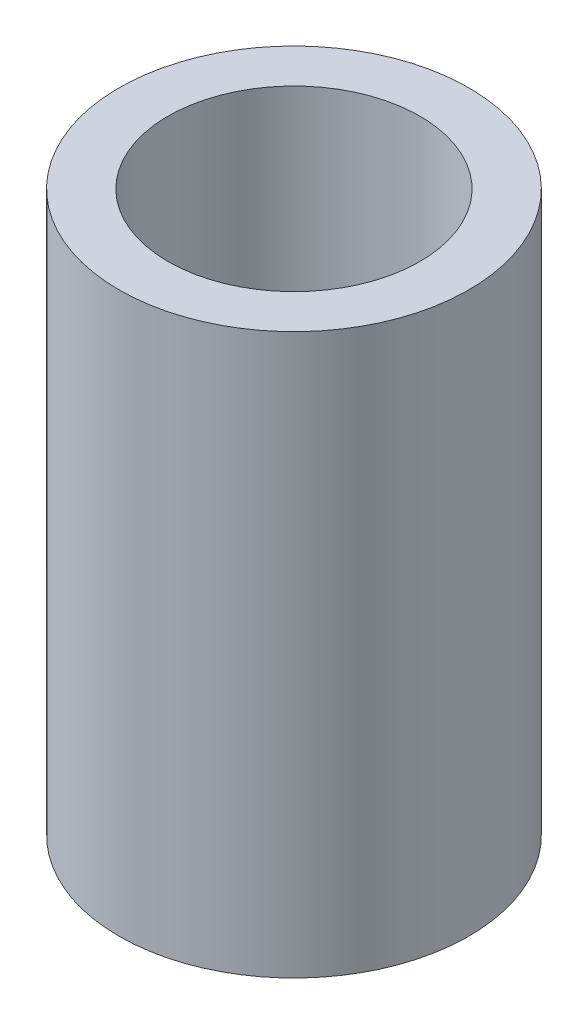
ISO-10303-21;
HEADER;
FILE_DESCRIPTION(('STEP AP214'),'2;1');
FILE_NAME('part.step','',(''),(''),'','','');
FILE_SCHEMA(('AUTOMOTIVE_DESIGN { 1 0 10303 214 1 1 1 1 }'));
ENDSEC;
DATA;
#1=APPLICATION_CONTEXT('core data for automotive mechanical design processes');
#2=APPLICATION_PROTOCOL_DEFINITION('international standard','automotive_design',2000,#1);
#3=PRODUCT_CONTEXT('',#1,'mechanical');
#4=PRODUCT('Part','Part','',(#3));
#5=PRODUCT_RELATED_PRODUCT_CATEGORY('part','',(#4));
#6=PRODUCT_DEFINITION_FORMATION('','',#4);
#7=PRODUCT_DEFINITION_CONTEXT('part definition',#1,'design');
#8=PRODUCT_DEFINITION('design','',#6,#7);
#9=PRODUCT_DEFINITION_SHAPE('','',#8);
#10=(LENGTH_UNIT() NAMED_UNIT(*) SI_UNIT(.MILLI.,.METRE.));
#11=(NAMED_UNIT(*) PLANE_ANGLE_UNIT() SI_UNIT($,.RADIAN.));
#12=(NAMED_UNIT(*) SI_UNIT($,.STERADIAN.) SOLID_ANGLE_UNIT());
#13=UNCERTAINTY_MEASURE_WITH_UNIT(LENGTH_MEASURE(1.E-05),#10,'distance_accuracy_value','');
#14=(GEOMETRIC_REPRESENTATION_CONTEXT(3) GLOBAL_UNCERTAINTY_ASSIGNED_CONTEXT((#13)) GLOBAL_UNIT_ASSIGNED_CONTEXT((#10,
#11,#12)) REPRESENTATION_CONTEXT('',''));
#15=CARTESIAN_POINT('',(0.,0.,0.));
#16=DIRECTION('',(0.,0.,1.));
#17=DIRECTION('',(1.,0.,0.));
#18=AXIS2_PLACEMENT_3D('',#15,#16,#17);
#19=CARTESIAN_POINT('',(-9.86534146915119,8.,1.7402953360488));
#20=DIRECTION('',(0.,1.,0.));
#21=DIRECTION('',(0.,0.,1.));
#22=AXIS2_PLACEMENT_3D('',#19,#20,#21);
#23=PLANE('',#22);
#24=CARTESIAN_POINT('',(-9.86534146915119,8.,1.7402953360488));
#25=DIRECTION('',(0.,1.,0.));
#26=DIRECTION('',(0.,0.,1.));
#27=AXIS2_PLACEMENT_3D('',#24,#25,#26);
#28=CIRCLE('',#27,2.5);
#29=CARTESIAN_POINT('',(-9.86534146915119,8.,4.2402953360488));
#30=VERTEX_POINT('',#29);
#31=EDGE_CURVE('E10',#30,#30,#28,.T.);
#32=ORIENTED_EDGE('',*,*,#31,.T.);
#33=EDGE_LOOP('',(#32));
#34=FACE_BOUND('',#33,.T.);
#35=CARTESIAN_POINT('',(-9.86534146915119,8.,1.7402953360488));
#36=DIRECTION('',(0.,1.,0.));
#37=DIRECTION('',(0.,0.,1.));
#38=AXIS2_PLACEMENT_3D('',#35,#36,#37);
#39=CIRCLE('',#38,1.8);
#40=CARTESIAN_POINT('',(-9.86534146915119,8.,3.5402953360488));
#41=VERTEX_POINT('',#40);
#42=EDGE_CURVE('E41',#41,#41,#39,.T.);
#43=ORIENTED_EDGE('',*,*,#42,.F.);
#44=EDGE_LOOP('',(#43));
#45=FACE_BOUND('',#44,.T.);
#46=ADVANCED_FACE('F30',(#34,#45),#23,.T.);
#47=CARTESIAN_POINT('',(-9.86534146915119,0.,1.7402953360488));
#48=DIRECTION('',(0.,1.,0.));
#49=DIRECTION('',(0.,0.,1.));
#50=AXIS2_PLACEMENT_3D('',#47,#48,#49);
#51=PLANE('',#50);
#52=CARTESIAN_POINT('',(-9.86534146915119,0.,1.7402953360488));
#53=DIRECTION('',(0.,1.,0.));
#54=DIRECTION('',(0.,0.,1.));
#55=AXIS2_PLACEMENT_3D('',#52,#53,#54);
#56=CIRCLE('',#55,2.5);
#57=CARTESIAN_POINT('',(-9.86534146915119,0.,4.2402953360488));
#58=VERTEX_POINT('',#57);
#59=EDGE_CURVE('E34',#58,#58,#56,.T.);
#60=ORIENTED_EDGE('',*,*,#59,.F.);
#61=EDGE_LOOP('',(#60));
#62=FACE_BOUND('',#61,.T.);
#63=CARTESIAN_POINT('',(-9.86534146915119,0.,1.7402953360488));
#64=DIRECTION('',(0.,1.,0.));
#65=DIRECTION('',(0.,0.,1.));
#66=AXIS2_PLACEMENT_3D('',#63,#64,#65);
#67=CIRCLE('',#66,1.8);
#68=CARTESIAN_POINT('',(-9.86534146915119,0.,3.5402953360488));
#69=VERTEX_POINT('',#68);
#70=EDGE_CURVE('E43',#69,#69,#67,.T.);
#71=ORIENTED_EDGE('',*,*,#70,.T.);
#72=EDGE_LOOP('',(#71));
#73=FACE_BOUND('',#72,.T.);
#74=ADVANCED_FACE('F53',(#62,#73),#51,.F.);
#75=CARTESIAN_POINT('',(-9.86534146915119,8.,1.7402953360488));
#76=DIRECTION('',(0.,-1.,0.));
#77=DIRECTION('',(0.,0.,-1.));
#78=AXIS2_PLACEMENT_3D('',#75,#76,#77);
#79=CYLINDRICAL_SURFACE('',#78,2.5);
#80=ORIENTED_EDGE('',*,*,#31,.F.);
#81=EDGE_LOOP('',(#80));
#82=FACE_BOUND('',#81,.T.);
#83=ORIENTED_EDGE('',*,*,#59,.T.);
#84=EDGE_LOOP('',(#83));
#85=FACE_BOUND('',#84,.T.);
#86=ADVANCED_FACE('F32',(#82,#85),#79,.T.);
#87=CARTESIAN_POINT('',(-9.86534146915119,8.,1.7402953360488));
#88=DIRECTION('',(0.,-1.,0.));
#89=DIRECTION('',(0.,0.,-1.));
#90=AXIS2_PLACEMENT_3D('',#87,#88,#89);
#91=CYLINDRICAL_SURFACE('',#90,1.8);
#92=ORIENTED_EDGE('',*,*,#42,.T.);
#93=EDGE_LOOP('',(#92));
#94=FACE_BOUND('',#93,.T.);
#95=ORIENTED_EDGE('',*,*,#70,.F.);
#96=EDGE_LOOP('',(#95));
#97=FACE_BOUND('',#96,.T.);
#98=ADVANCED_FACE('F49',(#94,#97),#91,.F.);
#99=CLOSED_SHELL('',(#46,#74,#86,#98));
#100=MANIFOLD_SOLID_BREP('B2',#99);
#101=ADVANCED_BREP_SHAPE_REPRESENTATION('',(#18,#100),#14);
#102=SHAPE_DEFINITION_REPRESENTATION(#9,#101);
ENDSEC;
END-ISO-10303-21;
